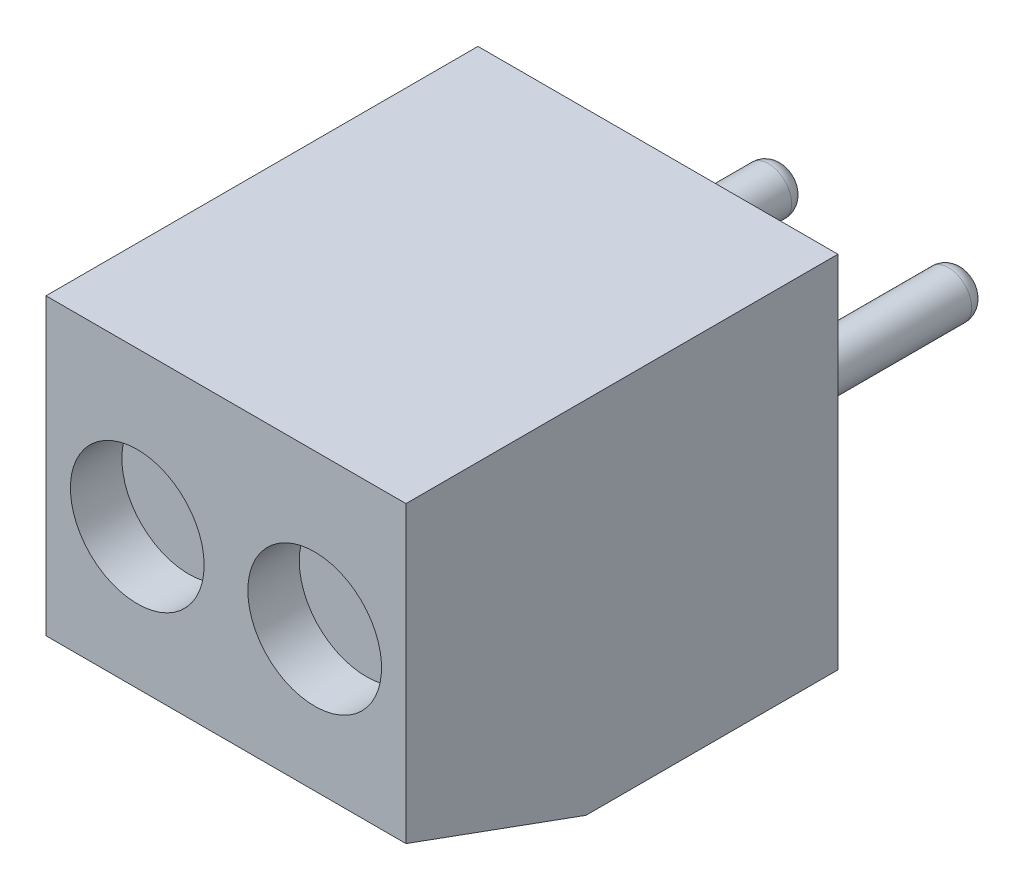
ISO-10303-21;
HEADER;
FILE_DESCRIPTION(('STEP AP214'),'2;1');
FILE_NAME('part.step','',(''),(''),'','','');
FILE_SCHEMA(('AUTOMOTIVE_DESIGN { 1 0 10303 214 1 1 1 1 }'));
ENDSEC;
DATA;
#1=APPLICATION_CONTEXT('core data for automotive mechanical design processes');
#2=APPLICATION_PROTOCOL_DEFINITION('international standard','automotive_design',2000,#1);
#3=PRODUCT_CONTEXT('',#1,'mechanical');
#4=PRODUCT('Part','Part','',(#3));
#5=PRODUCT_RELATED_PRODUCT_CATEGORY('part','',(#4));
#6=PRODUCT_DEFINITION_FORMATION('','',#4);
#7=PRODUCT_DEFINITION_CONTEXT('part definition',#1,'design');
#8=PRODUCT_DEFINITION('design','',#6,#7);
#9=PRODUCT_DEFINITION_SHAPE('','',#8);
#10=(LENGTH_UNIT() NAMED_UNIT(*) SI_UNIT(.MILLI.,.METRE.));
#11=(NAMED_UNIT(*) PLANE_ANGLE_UNIT() SI_UNIT($,.RADIAN.));
#12=(NAMED_UNIT(*) SI_UNIT($,.STERADIAN.) SOLID_ANGLE_UNIT());
#13=UNCERTAINTY_MEASURE_WITH_UNIT(LENGTH_MEASURE(1.E-05),#10,'distance_accuracy_value','');
#14=(GEOMETRIC_REPRESENTATION_CONTEXT(3) GLOBAL_UNCERTAINTY_ASSIGNED_CONTEXT((#13)) GLOBAL_UNIT_ASSIGNED_CONTEXT((#10,
#11,#12)) REPRESENTATION_CONTEXT('',''));
#15=CARTESIAN_POINT('',(0.,0.,0.));
#16=DIRECTION('',(0.,0.,1.));
#17=DIRECTION('',(1.,0.,0.));
#18=AXIS2_PLACEMENT_3D('',#15,#16,#17);
#19=CARTESIAN_POINT('',(0.,0.,0.));
#20=DIRECTION('',(0.,0.,-1.));
#21=DIRECTION('',(-1.,0.,0.));
#22=AXIS2_PLACEMENT_3D('',#19,#20,#21);
#23=PLANE('',#22);
#24=CARTESIAN_POINT('',(1.75,0.,0.));
#25=DIRECTION('',(0.,0.,-1.));
#26=DIRECTION('',(-1.,0.,0.));
#27=AXIS2_PLACEMENT_3D('',#24,#25,#26);
#28=CIRCLE('',#27,0.45);
#29=CARTESIAN_POINT('',(1.3,0.,0.));
#30=VERTEX_POINT('',#29);
#31=EDGE_CURVE('E322',#30,#30,#28,.T.);
#32=ORIENTED_EDGE('',*,*,#31,.F.);
#33=EDGE_LOOP('',(#32));
#34=FACE_BOUND('',#33,.T.);
#35=DIRECTION('',(0.,1.,0.));
#36=VECTOR('',#35,1.);
#37=CARTESIAN_POINT('',(3.5,-3.5,0.));
#38=LINE('',#37,#36);
#39=CARTESIAN_POINT('',(3.5,-3.5,0.));
#40=VERTEX_POINT('',#39);
#41=CARTESIAN_POINT('',(3.5,3.5,0.));
#42=VERTEX_POINT('',#41);
#43=EDGE_CURVE('E202',#40,#42,#38,.T.);
#44=ORIENTED_EDGE('',*,*,#43,.F.);
#45=DIRECTION('',(1.,0.,0.));
#46=VECTOR('',#45,1.);
#47=CARTESIAN_POINT('',(-3.5,-3.5,0.));
#48=LINE('',#47,#46);
#49=CARTESIAN_POINT('',(-3.5,-3.5,0.));
#50=VERTEX_POINT('',#49);
#51=EDGE_CURVE('E211',#50,#40,#48,.T.);
#52=ORIENTED_EDGE('',*,*,#51,.F.);
#53=DIRECTION('',(0.,-1.,0.));
#54=VECTOR('',#53,1.);
#55=CARTESIAN_POINT('',(-3.5,-3.5,0.));
#56=LINE('',#55,#54);
#57=CARTESIAN_POINT('',(-3.5,3.5,0.));
#58=VERTEX_POINT('',#57);
#59=EDGE_CURVE('E221',#58,#50,#56,.T.);
#60=ORIENTED_EDGE('',*,*,#59,.F.);
#61=DIRECTION('',(-1.,0.,0.));
#62=VECTOR('',#61,1.);
#63=CARTESIAN_POINT('',(-3.5,3.5,0.));
#64=LINE('',#63,#62);
#65=EDGE_CURVE('E219',#42,#58,#64,.T.);
#66=ORIENTED_EDGE('',*,*,#65,.F.);
#67=EDGE_LOOP('',(#44,#52,#60,#66));
#68=FACE_BOUND('',#67,.T.);
#69=CARTESIAN_POINT('',(-1.75,0.,0.));
#70=DIRECTION('',(0.,0.,-1.));
#71=DIRECTION('',(1.,0.,0.));
#72=AXIS2_PLACEMENT_3D('',#69,#70,#71);
#73=CIRCLE('',#72,0.45);
#74=CARTESIAN_POINT('',(-1.3,0.,0.));
#75=VERTEX_POINT('',#74);
#76=EDGE_CURVE('E320',#75,#75,#73,.T.);
#77=ORIENTED_EDGE('',*,*,#76,.F.);
#78=EDGE_LOOP('',(#77));
#79=FACE_BOUND('',#78,.T.);
#80=ADVANCED_FACE('F41',(#34,#68,#79),#23,.T.);
#81=CARTESIAN_POINT('',(3.5,-3.5,8.4));
#82=DIRECTION('',(-1.,0.,0.));
#83=DIRECTION('',(0.,0.,1.));
#84=AXIS2_PLACEMENT_3D('',#81,#82,#83);
#85=PLANE('',#84);
#86=DIRECTION('',(0.,1.,0.));
#87=VECTOR('',#86,1.);
#88=CARTESIAN_POINT('',(3.5,-3.5,8.4));
#89=LINE('',#88,#87);
#90=CARTESIAN_POINT('',(3.5,-2.22610418006829,8.4));
#91=VERTEX_POINT('',#90);
#92=CARTESIAN_POINT('',(3.5,3.5,8.4));
#93=VERTEX_POINT('',#92);
#94=EDGE_CURVE('E208',#91,#93,#89,.T.);
#95=ORIENTED_EDGE('',*,*,#94,.F.);
#96=DIRECTION('',(0.,0.342020143325666,0.939692620785909));
#97=VECTOR('',#96,1.);
#98=CARTESIAN_POINT('',(3.5,-2.22610418006829,8.4));
#99=LINE('',#98,#97);
#100=CARTESIAN_POINT('',(3.5,-3.5,4.89999999999997));
#101=VERTEX_POINT('',#100);
#102=EDGE_CURVE('E238',#91,#101,#99,.F.);
#103=ORIENTED_EDGE('',*,*,#102,.T.);
#104=DIRECTION('',(0.,0.,-1.));
#105=VECTOR('',#104,1.);
#106=CARTESIAN_POINT('',(3.5,-3.5,8.4));
#107=LINE('',#106,#105);
#108=EDGE_CURVE('E216',#101,#40,#107,.T.);
#109=ORIENTED_EDGE('',*,*,#108,.T.);
#110=ORIENTED_EDGE('',*,*,#43,.T.);
#111=DIRECTION('',(0.,0.,-1.));
#112=VECTOR('',#111,1.);
#113=CARTESIAN_POINT('',(3.5,3.5,8.4));
#114=LINE('',#113,#112);
#115=EDGE_CURVE('E232',#93,#42,#114,.T.);
#116=ORIENTED_EDGE('',*,*,#115,.F.);
#117=EDGE_LOOP('',(#95,#103,#109,#110,#116));
#118=FACE_BOUND('',#117,.T.);
#119=ADVANCED_FACE('F263',(#118),#85,.F.);
#120=CARTESIAN_POINT('',(-3.5,3.5,8.4));
#121=DIRECTION('',(0.,-1.,0.));
#122=DIRECTION('',(0.,0.,-1.));
#123=AXIS2_PLACEMENT_3D('',#120,#121,#122);
#124=PLANE('',#123);
#125=ORIENTED_EDGE('',*,*,#65,.T.);
#126=DIRECTION('',(0.,0.,-1.));
#127=VECTOR('',#126,1.);
#128=CARTESIAN_POINT('',(-3.5,3.5,8.4));
#129=LINE('',#128,#127);
#130=CARTESIAN_POINT('',(-3.5,3.5,8.4));
#131=VERTEX_POINT('',#130);
#132=EDGE_CURVE('E229',#131,#58,#129,.T.);
#133=ORIENTED_EDGE('',*,*,#132,.F.);
#134=DIRECTION('',(-1.,0.,0.));
#135=VECTOR('',#134,1.);
#136=CARTESIAN_POINT('',(-3.5,3.5,8.4));
#137=LINE('',#136,#135);
#138=EDGE_CURVE('E210',#93,#131,#137,.T.);
#139=ORIENTED_EDGE('',*,*,#138,.F.);
#140=ORIENTED_EDGE('',*,*,#115,.T.);
#141=EDGE_LOOP('',(#125,#133,#139,#140));
#142=FACE_BOUND('',#141,.T.);
#143=ADVANCED_FACE('F271',(#142),#124,.F.);
#144=CARTESIAN_POINT('',(-3.5,-3.5,8.4));
#145=DIRECTION('',(1.,0.,0.));
#146=DIRECTION('',(0.,0.,-1.));
#147=AXIS2_PLACEMENT_3D('',#144,#145,#146);
#148=PLANE('',#147);
#149=DIRECTION('',(0.,0.,-1.));
#150=VECTOR('',#149,1.);
#151=CARTESIAN_POINT('',(-3.5,-3.5,8.4));
#152=LINE('',#151,#150);
#153=CARTESIAN_POINT('',(-3.5,-3.5,4.89999999999997));
#154=VERTEX_POINT('',#153);
#155=EDGE_CURVE('E227',#154,#50,#152,.T.);
#156=ORIENTED_EDGE('',*,*,#155,.F.);
#157=DIRECTION('',(0.,-0.342020143325666,-0.939692620785909));
#158=VECTOR('',#157,1.);
#159=CARTESIAN_POINT('',(-3.5,-2.22610418006829,8.4));
#160=LINE('',#159,#158);
#161=CARTESIAN_POINT('',(-3.5,-2.22610418006829,8.4));
#162=VERTEX_POINT('',#161);
#163=EDGE_CURVE('E242',#154,#162,#160,.F.);
#164=ORIENTED_EDGE('',*,*,#163,.T.);
#165=DIRECTION('',(0.,-1.,0.));
#166=VECTOR('',#165,1.);
#167=CARTESIAN_POINT('',(-3.5,-3.5,8.4));
#168=LINE('',#167,#166);
#169=EDGE_CURVE('E213',#131,#162,#168,.T.);
#170=ORIENTED_EDGE('',*,*,#169,.F.);
#171=ORIENTED_EDGE('',*,*,#132,.T.);
#172=ORIENTED_EDGE('',*,*,#59,.T.);
#173=EDGE_LOOP('',(#156,#164,#170,#171,#172));
#174=FACE_BOUND('',#173,.T.);
#175=ADVANCED_FACE('F283',(#174),#148,.F.);
#176=CARTESIAN_POINT('',(-3.5,-3.5,8.4));
#177=DIRECTION('',(0.,1.,0.));
#178=DIRECTION('',(0.,0.,1.));
#179=AXIS2_PLACEMENT_3D('',#176,#177,#178);
#180=PLANE('',#179);
#181=DIRECTION('',(0.,0.,-1.));
#182=VECTOR('',#181,1.);
#183=CARTESIAN_POINT('',(0.3,-3.5,4.7));
#184=LINE('',#183,#182);
#185=CARTESIAN_POINT('',(0.3,-3.5,4.7));
#186=VERTEX_POINT('',#185);
#187=CARTESIAN_POINT('',(0.299999999999999,-3.5,0.5));
#188=VERTEX_POINT('',#187);
#189=EDGE_CURVE('E168',#186,#188,#184,.T.);
#190=ORIENTED_EDGE('',*,*,#189,.F.);
#191=DIRECTION('',(-1.,0.,0.));
#192=VECTOR('',#191,1.);
#193=CARTESIAN_POINT('',(3.15,-3.5,4.7));
#194=LINE('',#193,#192);
#195=CARTESIAN_POINT('',(3.15,-3.5,4.7));
#196=VERTEX_POINT('',#195);
#197=EDGE_CURVE('E56',#196,#186,#194,.T.);
#198=ORIENTED_EDGE('',*,*,#197,.F.);
#199=DIRECTION('',(0.,0.,1.));
#200=VECTOR('',#199,1.);
#201=CARTESIAN_POINT('',(3.15,-3.5,4.7));
#202=LINE('',#201,#200);
#203=CARTESIAN_POINT('',(3.15,-3.5,0.5));
#204=VERTEX_POINT('',#203);
#205=EDGE_CURVE('E156',#204,#196,#202,.T.);
#206=ORIENTED_EDGE('',*,*,#205,.F.);
#207=DIRECTION('',(1.,0.,0.));
#208=VECTOR('',#207,1.);
#209=CARTESIAN_POINT('',(3.15,-3.5,0.5));
#210=LINE('',#209,#208);
#211=EDGE_CURVE('E159',#188,#204,#210,.T.);
#212=ORIENTED_EDGE('',*,*,#211,.F.);
#213=EDGE_LOOP('',(#190,#198,#206,#212));
#214=FACE_BOUND('',#213,.T.);
#215=DIRECTION('',(1.,0.,0.));
#216=VECTOR('',#215,1.);
#217=CARTESIAN_POINT('',(-3.15,-3.5,0.5));
#218=LINE('',#217,#216);
#219=CARTESIAN_POINT('',(-3.15,-3.5,0.5));
#220=VERTEX_POINT('',#219);
#221=CARTESIAN_POINT('',(-0.299999999999999,-3.5,0.5));
#222=VERTEX_POINT('',#221);
#223=EDGE_CURVE('E192',#220,#222,#218,.T.);
#224=ORIENTED_EDGE('',*,*,#223,.F.);
#225=DIRECTION('',(0.,0.,-1.));
#226=VECTOR('',#225,1.);
#227=CARTESIAN_POINT('',(-3.15,-3.5,4.7));
#228=LINE('',#227,#226);
#229=CARTESIAN_POINT('',(-3.15,-3.5,4.7));
#230=VERTEX_POINT('',#229);
#231=EDGE_CURVE('E64',#230,#220,#228,.T.);
#232=ORIENTED_EDGE('',*,*,#231,.F.);
#233=DIRECTION('',(-1.,0.,0.));
#234=VECTOR('',#233,1.);
#235=CARTESIAN_POINT('',(-3.15,-3.5,4.7));
#236=LINE('',#235,#234);
#237=CARTESIAN_POINT('',(-0.3,-3.5,4.7));
#238=VERTEX_POINT('',#237);
#239=EDGE_CURVE('E181',#238,#230,#236,.T.);
#240=ORIENTED_EDGE('',*,*,#239,.F.);
#241=DIRECTION('',(0.,0.,1.));
#242=VECTOR('',#241,1.);
#243=CARTESIAN_POINT('',(-0.3,-3.5,4.7));
#244=LINE('',#243,#242);
#245=EDGE_CURVE('E195',#222,#238,#244,.T.);
#246=ORIENTED_EDGE('',*,*,#245,.F.);
#247=EDGE_LOOP('',(#224,#232,#240,#246));
#248=FACE_BOUND('',#247,.T.);
#249=ORIENTED_EDGE('',*,*,#108,.F.);
#250=DIRECTION('',(-1.,0.,0.));
#251=VECTOR('',#250,1.);
#252=CARTESIAN_POINT('',(-3.5,-3.5,4.89999999999997));
#253=LINE('',#252,#251);
#254=EDGE_CURVE('E240',#101,#154,#253,.T.);
#255=ORIENTED_EDGE('',*,*,#254,.T.);
#256=ORIENTED_EDGE('',*,*,#155,.T.);
#257=ORIENTED_EDGE('',*,*,#51,.T.);
#258=EDGE_LOOP('',(#249,#255,#256,#257));
#259=FACE_BOUND('',#258,.T.);
#260=ADVANCED_FACE('F280',(#214,#248,#259),#180,.F.);
#261=CARTESIAN_POINT('',(0.,0.,8.4));
#262=DIRECTION('',(0.,0.,-1.));
#263=DIRECTION('',(-1.,0.,0.));
#264=AXIS2_PLACEMENT_3D('',#261,#262,#263);
#265=PLANE('',#264);
#266=CARTESIAN_POINT('',(1.725,0.499999999999998,8.4));
#267=DIRECTION('',(0.,0.,1.));
#268=DIRECTION('',(-1.,0.,0.));
#269=AXIS2_PLACEMENT_3D('',#266,#267,#268);
#270=CIRCLE('',#269,1.3);
#271=CARTESIAN_POINT('',(0.425,0.499999999999998,8.4));
#272=VERTEX_POINT('',#271);
#273=EDGE_CURVE('E325',#272,#272,#270,.T.);
#274=ORIENTED_EDGE('',*,*,#273,.F.);
#275=EDGE_LOOP('',(#274));
#276=FACE_BOUND('',#275,.T.);
#277=CARTESIAN_POINT('',(-1.725,0.499999999999998,8.4));
#278=DIRECTION('',(0.,0.,1.));
#279=DIRECTION('',(1.,0.,0.));
#280=AXIS2_PLACEMENT_3D('',#277,#278,#279);
#281=CIRCLE('',#280,1.3);
#282=CARTESIAN_POINT('',(-0.425,0.499999999999998,8.4));
#283=VERTEX_POINT('',#282);
#284=EDGE_CURVE('E331',#283,#283,#281,.T.);
#285=ORIENTED_EDGE('',*,*,#284,.F.);
#286=EDGE_LOOP('',(#285));
#287=FACE_BOUND('',#286,.T.);
#288=ORIENTED_EDGE('',*,*,#169,.T.);
#289=DIRECTION('',(1.,0.,0.));
#290=VECTOR('',#289,1.);
#291=CARTESIAN_POINT('',(0.,-2.22610418006829,8.4));
#292=LINE('',#291,#290);
#293=EDGE_CURVE('E235',#162,#91,#292,.T.);
#294=ORIENTED_EDGE('',*,*,#293,.T.);
#295=ORIENTED_EDGE('',*,*,#94,.T.);
#296=ORIENTED_EDGE('',*,*,#138,.T.);
#297=EDGE_LOOP('',(#288,#294,#295,#296));
#298=FACE_BOUND('',#297,.T.);
#299=ADVANCED_FACE('F278',(#276,#287,#298),#265,.F.);
#300=CARTESIAN_POINT('',(0.,-2.22610418006829,8.4));
#301=DIRECTION('',(0.,0.939692620785909,-0.342020143325666));
#302=DIRECTION('',(1.,0.,0.));
#303=AXIS2_PLACEMENT_3D('',#300,#301,#302);
#304=PLANE('',#303);
#305=ORIENTED_EDGE('',*,*,#163,.F.);
#306=ORIENTED_EDGE('',*,*,#254,.F.);
#307=ORIENTED_EDGE('',*,*,#102,.F.);
#308=ORIENTED_EDGE('',*,*,#293,.F.);
#309=EDGE_LOOP('',(#305,#306,#307,#308));
#310=FACE_BOUND('',#309,.T.);
#311=ADVANCED_FACE('F291',(#310),#304,.F.);
#312=CARTESIAN_POINT('',(-3.15,-1.7,4.7));
#313=DIRECTION('',(-1.,0.,0.));
#314=DIRECTION('',(0.,0.,1.));
#315=AXIS2_PLACEMENT_3D('',#312,#313,#314);
#316=PLANE('',#315);
#317=ORIENTED_EDGE('',*,*,#231,.T.);
#318=DIRECTION('',(0.,-1.,0.));
#319=VECTOR('',#318,1.);
#320=CARTESIAN_POINT('',(-3.15,-1.7,0.5));
#321=LINE('',#320,#319);
#322=CARTESIAN_POINT('',(-3.15,-1.7,0.5));
#323=VERTEX_POINT('',#322);
#324=EDGE_CURVE('E190',#323,#220,#321,.T.);
#325=ORIENTED_EDGE('',*,*,#324,.F.);
#326=DIRECTION('',(0.,0.,-1.));
#327=VECTOR('',#326,1.);
#328=CARTESIAN_POINT('',(-3.15,-1.7,4.7));
#329=LINE('',#328,#327);
#330=CARTESIAN_POINT('',(-3.15,-1.7,4.7));
#331=VERTEX_POINT('',#330);
#332=EDGE_CURVE('E177',#331,#323,#329,.T.);
#333=ORIENTED_EDGE('',*,*,#332,.F.);
#334=DIRECTION('',(0.,-1.,0.));
#335=VECTOR('',#334,1.);
#336=CARTESIAN_POINT('',(-3.15,-1.7,4.7));
#337=LINE('',#336,#335);
#338=EDGE_CURVE('E200',#331,#230,#337,.T.);
#339=ORIENTED_EDGE('',*,*,#338,.T.);
#340=EDGE_LOOP('',(#317,#325,#333,#339));
#341=FACE_BOUND('',#340,.T.);
#342=ADVANCED_FACE('F293',(#341),#316,.F.);
#343=CARTESIAN_POINT('',(-3.15,-1.7,4.7));
#344=DIRECTION('',(0.,0.,1.));
#345=DIRECTION('',(1.,0.,0.));
#346=AXIS2_PLACEMENT_3D('',#343,#344,#345);
#347=PLANE('',#346);
#348=ORIENTED_EDGE('',*,*,#239,.T.);
#349=ORIENTED_EDGE('',*,*,#338,.F.);
#350=DIRECTION('',(-1.,0.,0.));
#351=VECTOR('',#350,1.);
#352=CARTESIAN_POINT('',(-3.15,-1.7,4.7));
#353=LINE('',#352,#351);
#354=CARTESIAN_POINT('',(-0.3,-1.7,4.7));
#355=VERTEX_POINT('',#354);
#356=EDGE_CURVE('E187',#355,#331,#353,.T.);
#357=ORIENTED_EDGE('',*,*,#356,.F.);
#358=DIRECTION('',(0.,-1.,0.));
#359=VECTOR('',#358,1.);
#360=CARTESIAN_POINT('',(-0.3,-1.7,4.7));
#361=LINE('',#360,#359);
#362=EDGE_CURVE('E203',#355,#238,#361,.T.);
#363=ORIENTED_EDGE('',*,*,#362,.T.);
#364=EDGE_LOOP('',(#348,#349,#357,#363));
#365=FACE_BOUND('',#364,.T.);
#366=ADVANCED_FACE('F299',(#365),#347,.F.);
#367=CARTESIAN_POINT('',(-0.3,-1.7,4.7));
#368=DIRECTION('',(1.,0.,0.));
#369=DIRECTION('',(0.,0.,-1.));
#370=AXIS2_PLACEMENT_3D('',#367,#368,#369);
#371=PLANE('',#370);
#372=ORIENTED_EDGE('',*,*,#245,.T.);
#373=ORIENTED_EDGE('',*,*,#362,.F.);
#374=DIRECTION('',(0.,0.,1.));
#375=VECTOR('',#374,1.);
#376=CARTESIAN_POINT('',(-0.3,-1.7,4.7));
#377=LINE('',#376,#375);
#378=CARTESIAN_POINT('',(-0.299999999999999,-1.7,0.5));
#379=VERTEX_POINT('',#378);
#380=EDGE_CURVE('E184',#379,#355,#377,.T.);
#381=ORIENTED_EDGE('',*,*,#380,.F.);
#382=DIRECTION('',(0.,-1.,0.));
#383=VECTOR('',#382,1.);
#384=CARTESIAN_POINT('',(-0.299999999999999,-1.7,0.5));
#385=LINE('',#384,#383);
#386=EDGE_CURVE('E205',#379,#222,#385,.T.);
#387=ORIENTED_EDGE('',*,*,#386,.T.);
#388=EDGE_LOOP('',(#372,#373,#381,#387));
#389=FACE_BOUND('',#388,.T.);
#390=ADVANCED_FACE('F389',(#389),#371,.F.);
#391=CARTESIAN_POINT('',(-3.15,-1.7,0.5));
#392=DIRECTION('',(0.,0.,-1.));
#393=DIRECTION('',(-1.,0.,0.));
#394=AXIS2_PLACEMENT_3D('',#391,#392,#393);
#395=PLANE('',#394);
#396=ORIENTED_EDGE('',*,*,#223,.T.);
#397=ORIENTED_EDGE('',*,*,#386,.F.);
#398=DIRECTION('',(1.,0.,0.));
#399=VECTOR('',#398,1.);
#400=CARTESIAN_POINT('',(-3.15,-1.7,0.5));
#401=LINE('',#400,#399);
#402=EDGE_CURVE('E180',#323,#379,#401,.T.);
#403=ORIENTED_EDGE('',*,*,#402,.F.);
#404=ORIENTED_EDGE('',*,*,#324,.T.);
#405=EDGE_LOOP('',(#396,#397,#403,#404));
#406=FACE_BOUND('',#405,.T.);
#407=ADVANCED_FACE('F385',(#406),#395,.F.);
#408=CARTESIAN_POINT('',(0.,-1.7,0.));
#409=DIRECTION('',(0.,-1.,0.));
#410=DIRECTION('',(0.,0.,-1.));
#411=AXIS2_PLACEMENT_3D('',#408,#409,#410);
#412=PLANE('',#411);
#413=CARTESIAN_POINT('',(-1.725,-1.7,2.6));
#414=DIRECTION('',(0.,-1.,0.));
#415=DIRECTION('',(0.,0.,-1.));
#416=AXIS2_PLACEMENT_3D('',#413,#414,#415);
#417=CIRCLE('',#416,1.);
#418=CARTESIAN_POINT('',(-1.725,-1.7,1.6));
#419=VERTEX_POINT('',#418);
#420=EDGE_CURVE('E344',#419,#419,#417,.T.);
#421=ORIENTED_EDGE('',*,*,#420,.F.);
#422=EDGE_LOOP('',(#421));
#423=FACE_BOUND('',#422,.T.);
#424=ORIENTED_EDGE('',*,*,#332,.T.);
#425=ORIENTED_EDGE('',*,*,#402,.T.);
#426=ORIENTED_EDGE('',*,*,#380,.T.);
#427=ORIENTED_EDGE('',*,*,#356,.T.);
#428=EDGE_LOOP('',(#424,#425,#426,#427));
#429=FACE_BOUND('',#428,.T.);
#430=ADVANCED_FACE('F382',(#423,#429),#412,.T.);
#431=CARTESIAN_POINT('',(3.15,-1.7,4.7));
#432=DIRECTION('',(0.,0.,1.));
#433=DIRECTION('',(1.,0.,0.));
#434=AXIS2_PLACEMENT_3D('',#431,#432,#433);
#435=PLANE('',#434);
#436=ORIENTED_EDGE('',*,*,#197,.T.);
#437=DIRECTION('',(0.,-1.,0.));
#438=VECTOR('',#437,1.);
#439=CARTESIAN_POINT('',(0.3,-1.7,4.7));
#440=LINE('',#439,#438);
#441=CARTESIAN_POINT('',(0.3,-1.7,4.7));
#442=VERTEX_POINT('',#441);
#443=EDGE_CURVE('E134',#442,#186,#440,.T.);
#444=ORIENTED_EDGE('',*,*,#443,.F.);
#445=DIRECTION('',(-1.,0.,0.));
#446=VECTOR('',#445,1.);
#447=CARTESIAN_POINT('',(3.15,-1.7,4.7));
#448=LINE('',#447,#446);
#449=CARTESIAN_POINT('',(3.15,-1.7,4.7));
#450=VERTEX_POINT('',#449);
#451=EDGE_CURVE('E138',#450,#442,#448,.T.);
#452=ORIENTED_EDGE('',*,*,#451,.F.);
#453=DIRECTION('',(0.,-1.,0.));
#454=VECTOR('',#453,1.);
#455=CARTESIAN_POINT('',(3.15,-1.7,4.7));
#456=LINE('',#455,#454);
#457=EDGE_CURVE('E172',#450,#196,#456,.T.);
#458=ORIENTED_EDGE('',*,*,#457,.T.);
#459=EDGE_LOOP('',(#436,#444,#452,#458));
#460=FACE_BOUND('',#459,.T.);
#461=ADVANCED_FACE('F136',(#460),#435,.F.);
#462=CARTESIAN_POINT('',(3.15,-1.7,4.7));
#463=DIRECTION('',(1.,0.,0.));
#464=DIRECTION('',(0.,0.,-1.));
#465=AXIS2_PLACEMENT_3D('',#462,#463,#464);
#466=PLANE('',#465);
#467=ORIENTED_EDGE('',*,*,#205,.T.);
#468=ORIENTED_EDGE('',*,*,#457,.F.);
#469=DIRECTION('',(0.,0.,1.));
#470=VECTOR('',#469,1.);
#471=CARTESIAN_POINT('',(3.15,-1.7,4.7));
#472=LINE('',#471,#470);
#473=CARTESIAN_POINT('',(3.15,-1.7,0.5));
#474=VERTEX_POINT('',#473);
#475=EDGE_CURVE('E144',#474,#450,#472,.T.);
#476=ORIENTED_EDGE('',*,*,#475,.F.);
#477=DIRECTION('',(0.,-1.,0.));
#478=VECTOR('',#477,1.);
#479=CARTESIAN_POINT('',(3.15,-1.7,0.5));
#480=LINE('',#479,#478);
#481=EDGE_CURVE('E174',#474,#204,#480,.T.);
#482=ORIENTED_EDGE('',*,*,#481,.T.);
#483=EDGE_LOOP('',(#467,#468,#476,#482));
#484=FACE_BOUND('',#483,.T.);
#485=ADVANCED_FACE('F370',(#484),#466,.F.);
#486=CARTESIAN_POINT('',(3.15,-1.7,0.5));
#487=DIRECTION('',(0.,0.,-1.));
#488=DIRECTION('',(-1.,0.,0.));
#489=AXIS2_PLACEMENT_3D('',#486,#487,#488);
#490=PLANE('',#489);
#491=ORIENTED_EDGE('',*,*,#211,.T.);
#492=ORIENTED_EDGE('',*,*,#481,.F.);
#493=DIRECTION('',(1.,0.,0.));
#494=VECTOR('',#493,1.);
#495=CARTESIAN_POINT('',(3.15,-1.7,0.5));
#496=LINE('',#495,#494);
#497=CARTESIAN_POINT('',(0.299999999999999,-1.7,0.5));
#498=VERTEX_POINT('',#497);
#499=EDGE_CURVE('E152',#498,#474,#496,.T.);
#500=ORIENTED_EDGE('',*,*,#499,.F.);
#501=DIRECTION('',(0.,-1.,0.));
#502=VECTOR('',#501,1.);
#503=CARTESIAN_POINT('',(0.299999999999999,-1.7,0.5));
#504=LINE('',#503,#502);
#505=EDGE_CURVE('E143',#498,#188,#504,.T.);
#506=ORIENTED_EDGE('',*,*,#505,.T.);
#507=EDGE_LOOP('',(#491,#492,#500,#506));
#508=FACE_BOUND('',#507,.T.);
#509=ADVANCED_FACE('F373',(#508),#490,.F.);
#510=CARTESIAN_POINT('',(0.3,-1.7,4.7));
#511=DIRECTION('',(-1.,0.,0.));
#512=DIRECTION('',(0.,0.,1.));
#513=AXIS2_PLACEMENT_3D('',#510,#511,#512);
#514=PLANE('',#513);
#515=ORIENTED_EDGE('',*,*,#189,.T.);
#516=ORIENTED_EDGE('',*,*,#505,.F.);
#517=DIRECTION('',(0.,0.,-1.));
#518=VECTOR('',#517,1.);
#519=CARTESIAN_POINT('',(0.3,-1.7,4.7));
#520=LINE('',#519,#518);
#521=EDGE_CURVE('E147',#442,#498,#520,.T.);
#522=ORIENTED_EDGE('',*,*,#521,.F.);
#523=ORIENTED_EDGE('',*,*,#443,.T.);
#524=EDGE_LOOP('',(#515,#516,#522,#523));
#525=FACE_BOUND('',#524,.T.);
#526=ADVANCED_FACE('F148',(#525),#514,.F.);
#527=CARTESIAN_POINT('',(0.,-1.7,0.));
#528=DIRECTION('',(0.,-1.,0.));
#529=DIRECTION('',(0.,0.,-1.));
#530=AXIS2_PLACEMENT_3D('',#527,#528,#529);
#531=PLANE('',#530);
#532=CARTESIAN_POINT('',(1.725,-1.7,2.6));
#533=DIRECTION('',(0.,-1.,0.));
#534=DIRECTION('',(0.,0.,1.));
#535=AXIS2_PLACEMENT_3D('',#532,#533,#534);
#536=CIRCLE('',#535,1.);
#537=CARTESIAN_POINT('',(1.725,-1.7,3.6));
#538=VERTEX_POINT('',#537);
#539=EDGE_CURVE('E337',#538,#538,#536,.T.);
#540=ORIENTED_EDGE('',*,*,#539,.F.);
#541=EDGE_LOOP('',(#540));
#542=FACE_BOUND('',#541,.T.);
#543=ORIENTED_EDGE('',*,*,#451,.T.);
#544=ORIENTED_EDGE('',*,*,#521,.T.);
#545=ORIENTED_EDGE('',*,*,#499,.T.);
#546=ORIENTED_EDGE('',*,*,#475,.T.);
#547=EDGE_LOOP('',(#543,#544,#545,#546));
#548=FACE_BOUND('',#547,.T.);
#549=ADVANCED_FACE('F154',(#542,#548),#531,.T.);
#550=CARTESIAN_POINT('',(-1.725,6.32842712474619,2.6));
#551=DIRECTION('',(0.,-1.,0.));
#552=DIRECTION('',(0.,0.,-1.));
#553=AXIS2_PLACEMENT_3D('',#550,#551,#552);
#554=CYLINDRICAL_SURFACE('',#553,1.);
#555=CARTESIAN_POINT('',(-1.725,2.5,2.6));
#556=DIRECTION('',(0.,-1.,0.));
#557=DIRECTION('',(0.,0.,-1.));
#558=AXIS2_PLACEMENT_3D('',#555,#556,#557);
#559=CIRCLE('',#558,1.);
#560=CARTESIAN_POINT('',(-1.725,2.5,1.6));
#561=VERTEX_POINT('',#560);
#562=EDGE_CURVE('E162',#561,#561,#559,.F.);
#563=ORIENTED_EDGE('',*,*,#562,.T.);
#564=EDGE_LOOP('',(#563));
#565=FACE_BOUND('',#564,.T.);
#566=ORIENTED_EDGE('',*,*,#420,.T.);
#567=EDGE_LOOP('',(#566));
#568=FACE_BOUND('',#567,.T.);
#569=ADVANCED_FACE('F351',(#565,#568),#554,.F.);
#570=CARTESIAN_POINT('',(-3.5,2.5,8.4));
#571=DIRECTION('',(0.,-1.,0.));
#572=DIRECTION('',(0.,0.,-1.));
#573=AXIS2_PLACEMENT_3D('',#570,#571,#572);
#574=PLANE('',#573);
#575=ORIENTED_EDGE('',*,*,#562,.F.);
#576=EDGE_LOOP('',(#575));
#577=FACE_BOUND('',#576,.T.);
#578=ADVANCED_FACE('F353',(#577),#574,.T.);
#579=CARTESIAN_POINT('',(1.725,6.32842712474619,2.6));
#580=DIRECTION('',(0.,-1.,0.));
#581=DIRECTION('',(0.,0.,-1.));
#582=AXIS2_PLACEMENT_3D('',#579,#580,#581);
#583=CYLINDRICAL_SURFACE('',#582,1.);
#584=CARTESIAN_POINT('',(1.725,2.5,2.6));
#585=DIRECTION('',(0.,-1.,0.));
#586=DIRECTION('',(0.,0.,-1.));
#587=AXIS2_PLACEMENT_3D('',#584,#585,#586);
#588=CIRCLE('',#587,1.);
#589=CARTESIAN_POINT('',(1.725,2.5,1.6));
#590=VERTEX_POINT('',#589);
#591=EDGE_CURVE('E342',#590,#590,#588,.F.);
#592=ORIENTED_EDGE('',*,*,#591,.T.);
#593=EDGE_LOOP('',(#592));
#594=FACE_BOUND('',#593,.T.);
#595=ORIENTED_EDGE('',*,*,#539,.T.);
#596=EDGE_LOOP('',(#595));
#597=FACE_BOUND('',#596,.T.);
#598=ADVANCED_FACE('F355',(#594,#597),#583,.F.);
#599=CARTESIAN_POINT('',(-3.5,2.5,8.4));
#600=DIRECTION('',(0.,-1.,0.));
#601=DIRECTION('',(0.,0.,-1.));
#602=AXIS2_PLACEMENT_3D('',#599,#600,#601);
#603=PLANE('',#602);
#604=ORIENTED_EDGE('',*,*,#591,.F.);
#605=EDGE_LOOP('',(#604));
#606=FACE_BOUND('',#605,.T.);
#607=ADVANCED_FACE('F361',(#606),#603,.T.);
#608=CARTESIAN_POINT('',(-1.725,0.499999999999998,7.4));
#609=DIRECTION('',(0.,0.,1.));
#610=DIRECTION('',(1.,0.,0.));
#611=AXIS2_PLACEMENT_3D('',#608,#609,#610);
#612=CYLINDRICAL_SURFACE('',#611,1.3);
#613=CARTESIAN_POINT('',(-1.725,0.499999999999998,7.4));
#614=DIRECTION('',(0.,0.,1.));
#615=DIRECTION('',(1.,0.,0.));
#616=AXIS2_PLACEMENT_3D('',#613,#614,#615);
#617=CIRCLE('',#616,1.3);
#618=CARTESIAN_POINT('',(-0.425,0.499999999999998,7.4));
#619=VERTEX_POINT('',#618);
#620=EDGE_CURVE('E334',#619,#619,#617,.T.);
#621=ORIENTED_EDGE('',*,*,#620,.F.);
#622=EDGE_LOOP('',(#621));
#623=FACE_BOUND('',#622,.T.);
#624=ORIENTED_EDGE('',*,*,#284,.T.);
#625=EDGE_LOOP('',(#624));
#626=FACE_BOUND('',#625,.T.);
#627=ADVANCED_FACE('F461',(#623,#626),#612,.F.);
#628=CARTESIAN_POINT('',(-1.725,0.499999999999998,7.4));
#629=DIRECTION('',(0.,0.,1.));
#630=DIRECTION('',(1.,0.,0.));
#631=AXIS2_PLACEMENT_3D('',#628,#629,#630);
#632=PLANE('',#631);
#633=ORIENTED_EDGE('',*,*,#620,.T.);
#634=EDGE_LOOP('',(#633));
#635=FACE_BOUND('',#634,.T.);
#636=ADVANCED_FACE('F475',(#635),#632,.T.);
#637=CARTESIAN_POINT('',(1.725,0.499999999999998,7.4));
#638=DIRECTION('',(0.,0.,1.));
#639=DIRECTION('',(1.,0.,0.));
#640=AXIS2_PLACEMENT_3D('',#637,#638,#639);
#641=CYLINDRICAL_SURFACE('',#640,1.3);
#642=CARTESIAN_POINT('',(1.725,0.499999999999998,7.4));
#643=DIRECTION('',(0.,0.,1.));
#644=DIRECTION('',(-1.,0.,0.));
#645=AXIS2_PLACEMENT_3D('',#642,#643,#644);
#646=CIRCLE('',#645,1.3);
#647=CARTESIAN_POINT('',(0.425,0.499999999999998,7.4));
#648=VERTEX_POINT('',#647);
#649=EDGE_CURVE('E328',#648,#648,#646,.T.);
#650=ORIENTED_EDGE('',*,*,#649,.F.);
#651=EDGE_LOOP('',(#650));
#652=FACE_BOUND('',#651,.T.);
#653=ORIENTED_EDGE('',*,*,#273,.T.);
#654=EDGE_LOOP('',(#653));
#655=FACE_BOUND('',#654,.T.);
#656=ADVANCED_FACE('F486',(#652,#655),#641,.F.);
#657=CARTESIAN_POINT('',(1.725,0.499999999999998,7.4));
#658=DIRECTION('',(0.,0.,-1.));
#659=DIRECTION('',(-1.,0.,0.));
#660=AXIS2_PLACEMENT_3D('',#657,#658,#659);
#661=PLANE('',#660);
#662=ORIENTED_EDGE('',*,*,#649,.T.);
#663=EDGE_LOOP('',(#662));
#664=FACE_BOUND('',#663,.T.);
#665=ADVANCED_FACE('F497',(#664),#661,.F.);
#666=CARTESIAN_POINT('',(1.75,0.,-4.2));
#667=DIRECTION('',(0.,0.,1.));
#668=DIRECTION('',(1.,0.,0.));
#669=AXIS2_PLACEMENT_3D('',#666,#667,#668);
#670=CYLINDRICAL_SURFACE('',#669,0.45);
#671=CARTESIAN_POINT('',(1.75,0.,-3.9));
#672=DIRECTION('',(0.,0.,-1.));
#673=DIRECTION('',(-1.,0.,0.));
#674=AXIS2_PLACEMENT_3D('',#671,#672,#673);
#675=CIRCLE('',#674,0.45);
#676=CARTESIAN_POINT('',(1.3,0.,-3.9));
#677=VERTEX_POINT('',#676);
#678=EDGE_CURVE('E247',#677,#677,#675,.F.);
#679=ORIENTED_EDGE('',*,*,#678,.T.);
#680=EDGE_LOOP('',(#679));
#681=FACE_BOUND('',#680,.T.);
#682=ORIENTED_EDGE('',*,*,#31,.T.);
#683=EDGE_LOOP('',(#682));
#684=FACE_BOUND('',#683,.T.);
#685=ADVANCED_FACE('F506',(#681,#684),#670,.T.);
#686=CARTESIAN_POINT('',(1.75,0.,-4.2));
#687=DIRECTION('',(0.,0.,-1.));
#688=DIRECTION('',(-1.,0.,0.));
#689=AXIS2_PLACEMENT_3D('',#686,#687,#688);
#690=PLANE('',#689);
#691=CARTESIAN_POINT('',(1.75,0.,-4.2));
#692=DIRECTION('',(0.,0.,-1.));
#693=DIRECTION('',(-1.,0.,0.));
#694=AXIS2_PLACEMENT_3D('',#691,#692,#693);
#695=CIRCLE('',#694,0.15);
#696=CARTESIAN_POINT('',(1.6,0.,-4.2));
#697=VERTEX_POINT('',#696);
#698=EDGE_CURVE('E244',#697,#697,#695,.T.);
#699=ORIENTED_EDGE('',*,*,#698,.T.);
#700=EDGE_LOOP('',(#699));
#701=FACE_BOUND('',#700,.T.);
#702=ADVANCED_FACE('F523',(#701),#690,.T.);
#703=CARTESIAN_POINT('',(-1.75,0.,-4.2));
#704=DIRECTION('',(0.,0.,1.));
#705=DIRECTION('',(1.,0.,0.));
#706=AXIS2_PLACEMENT_3D('',#703,#704,#705);
#707=CYLINDRICAL_SURFACE('',#706,0.45);
#708=CARTESIAN_POINT('',(-1.75,0.,-3.9));
#709=DIRECTION('',(0.,0.,1.));
#710=DIRECTION('',(1.,0.,0.));
#711=AXIS2_PLACEMENT_3D('',#708,#709,#710);
#712=CIRCLE('',#711,0.45);
#713=CARTESIAN_POINT('',(-1.3,0.,-3.9));
#714=VERTEX_POINT('',#713);
#715=EDGE_CURVE('E12',#714,#714,#712,.T.);
#716=ORIENTED_EDGE('',*,*,#715,.T.);
#717=EDGE_LOOP('',(#716));
#718=FACE_BOUND('',#717,.T.);
#719=ORIENTED_EDGE('',*,*,#76,.T.);
#720=EDGE_LOOP('',(#719));
#721=FACE_BOUND('',#720,.T.);
#722=ADVANCED_FACE('F530',(#718,#721),#707,.T.);
#723=CARTESIAN_POINT('',(-1.75,0.,-4.2));
#724=DIRECTION('',(0.,0.,1.));
#725=DIRECTION('',(1.,0.,0.));
#726=AXIS2_PLACEMENT_3D('',#723,#724,#725);
#727=PLANE('',#726);
#728=CARTESIAN_POINT('',(-1.75,0.,-4.2));
#729=DIRECTION('',(0.,0.,1.));
#730=DIRECTION('',(1.,0.,0.));
#731=AXIS2_PLACEMENT_3D('',#728,#729,#730);
#732=CIRCLE('',#731,0.15);
#733=CARTESIAN_POINT('',(-1.6,0.,-4.2));
#734=VERTEX_POINT('',#733);
#735=EDGE_CURVE('E49',#734,#734,#732,.F.);
#736=ORIENTED_EDGE('',*,*,#735,.T.);
#737=EDGE_LOOP('',(#736));
#738=FACE_BOUND('',#737,.T.);
#739=ADVANCED_FACE('F252',(#738),#727,.F.);
#740=CARTESIAN_POINT('',(1.75,0.,-3.9));
#741=DIRECTION('',(0.,0.,-1.));
#742=DIRECTION('',(-1.,0.,0.));
#743=AXIS2_PLACEMENT_3D('',#740,#741,#742);
#744=DEGENERATE_TOROIDAL_SURFACE('',#743,0.15,0.3,.T.);
#745=ORIENTED_EDGE('',*,*,#678,.F.);
#746=EDGE_LOOP('',(#745));
#747=FACE_BOUND('',#746,.T.);
#748=ORIENTED_EDGE('',*,*,#698,.F.);
#749=EDGE_LOOP('',(#748));
#750=FACE_BOUND('',#749,.T.);
#751=ADVANCED_FACE('F255',(#747,#750),#744,.T.);
#752=CARTESIAN_POINT('',(-1.75,0.,-3.9));
#753=DIRECTION('',(0.,0.,1.));
#754=DIRECTION('',(1.,0.,0.));
#755=AXIS2_PLACEMENT_3D('',#752,#753,#754);
#756=DEGENERATE_TOROIDAL_SURFACE('',#755,0.15,0.3,.T.);
#757=ORIENTED_EDGE('',*,*,#715,.F.);
#758=EDGE_LOOP('',(#757));
#759=FACE_BOUND('',#758,.T.);
#760=ORIENTED_EDGE('',*,*,#735,.F.);
#761=EDGE_LOOP('',(#760));
#762=FACE_BOUND('',#761,.T.);
#763=ADVANCED_FACE('F43',(#759,#762),#756,.T.);
#764=CLOSED_SHELL('',(#80,#119,#143,#175,#260,#299,#311,#342,#366,#390,#407,#430,#461,#485,#509,
#526,#549,#569,#578,#598,#607,#627,#636,#656,#665,#685,#702,#722,#739,#751,#763));
#765=MANIFOLD_SOLID_BREP('B2',#764);
#766=ADVANCED_BREP_SHAPE_REPRESENTATION('',(#18,#765),#14);
#767=SHAPE_DEFINITION_REPRESENTATION(#9,#766);
ENDSEC;
END-ISO-10303-21;
